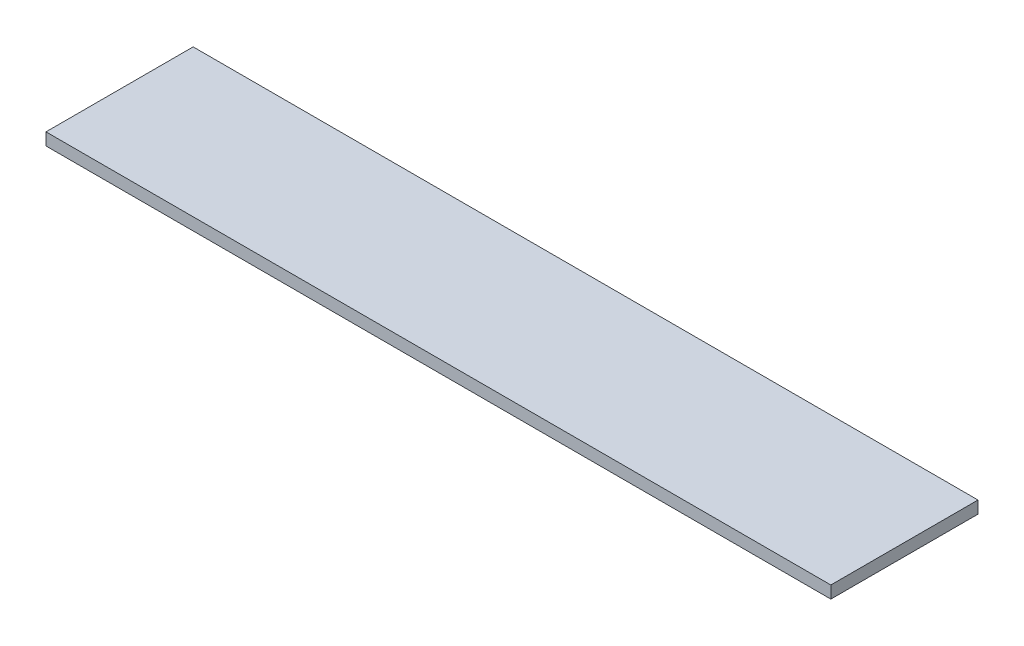
ISO-10303-21;
HEADER;
FILE_DESCRIPTION(('STEP AP214'),'2;1');
FILE_NAME('part.step','',(''),(''),'','','');
FILE_SCHEMA(('AUTOMOTIVE_DESIGN { 1 0 10303 214 1 1 1 1 }'));
ENDSEC;
DATA;
#1=APPLICATION_CONTEXT('core data for automotive mechanical design processes');
#2=APPLICATION_PROTOCOL_DEFINITION('international standard','automotive_design',2000,#1);
#3=PRODUCT_CONTEXT('',#1,'mechanical');
#4=PRODUCT('Part','Part','',(#3));
#5=PRODUCT_RELATED_PRODUCT_CATEGORY('part','',(#4));
#6=PRODUCT_DEFINITION_FORMATION('','',#4);
#7=PRODUCT_DEFINITION_CONTEXT('part definition',#1,'design');
#8=PRODUCT_DEFINITION('design','',#6,#7);
#9=PRODUCT_DEFINITION_SHAPE('','',#8);
#10=(LENGTH_UNIT() NAMED_UNIT(*) SI_UNIT(.MILLI.,.METRE.));
#11=(NAMED_UNIT(*) PLANE_ANGLE_UNIT() SI_UNIT($,.RADIAN.));
#12=(NAMED_UNIT(*) SI_UNIT($,.STERADIAN.) SOLID_ANGLE_UNIT());
#13=UNCERTAINTY_MEASURE_WITH_UNIT(LENGTH_MEASURE(1.E-05),#10,'distance_accuracy_value','');
#14=(GEOMETRIC_REPRESENTATION_CONTEXT(3) GLOBAL_UNCERTAINTY_ASSIGNED_CONTEXT((#13)) GLOBAL_UNIT_ASSIGNED_CONTEXT((#10,
#11,#12)) REPRESENTATION_CONTEXT('',''));
#15=CARTESIAN_POINT('',(0.,0.,0.));
#16=DIRECTION('',(0.,0.,1.));
#17=DIRECTION('',(1.,0.,0.));
#18=AXIS2_PLACEMENT_3D('',#15,#16,#17);
#19=CARTESIAN_POINT('',(0.,6.35,0.));
#20=DIRECTION('',(1.,0.,0.));
#21=DIRECTION('',(0.,0.,1.));
#22=AXIS2_PLACEMENT_3D('',#19,#20,#21);
#23=PLANE('',#22);
#24=DIRECTION('',(0.,0.,-1.));
#25=VECTOR('',#24,1.);
#26=CARTESIAN_POINT('',(0.,0.,0.));
#27=LINE('',#26,#25);
#28=CARTESIAN_POINT('',(0.,0.,76.2));
#29=VERTEX_POINT('',#28);
#30=CARTESIAN_POINT('',(0.,0.,0.));
#31=VERTEX_POINT('',#30);
#32=EDGE_CURVE('E102',#29,#31,#27,.T.);
#33=ORIENTED_EDGE('',*,*,#32,.F.);
#34=DIRECTION('',(0.,-1.,0.));
#35=VECTOR('',#34,1.);
#36=CARTESIAN_POINT('',(0.,6.35,76.2));
#37=LINE('',#36,#35);
#38=CARTESIAN_POINT('',(0.,6.35,76.2));
#39=VERTEX_POINT('',#38);
#40=EDGE_CURVE('E101',#39,#29,#37,.T.);
#41=ORIENTED_EDGE('',*,*,#40,.F.);
#42=DIRECTION('',(0.,0.,-1.));
#43=VECTOR('',#42,1.);
#44=CARTESIAN_POINT('',(0.,6.35,0.));
#45=LINE('',#44,#43);
#46=CARTESIAN_POINT('',(0.,6.35,0.));
#47=VERTEX_POINT('',#46);
#48=EDGE_CURVE('E96',#39,#47,#45,.T.);
#49=ORIENTED_EDGE('',*,*,#48,.T.);
#50=DIRECTION('',(0.,-1.,0.));
#51=VECTOR('',#50,1.);
#52=CARTESIAN_POINT('',(0.,6.35,0.));
#53=LINE('',#52,#51);
#54=EDGE_CURVE('E11',#47,#31,#53,.T.);
#55=ORIENTED_EDGE('',*,*,#54,.T.);
#56=EDGE_LOOP('',(#33,#41,#49,#55));
#57=FACE_BOUND('',#56,.T.);
#58=ADVANCED_FACE('F39',(#57),#23,.F.);
#59=CARTESIAN_POINT('',(0.,6.35,0.));
#60=DIRECTION('',(0.,0.,1.));
#61=DIRECTION('',(-1.,0.,0.));
#62=AXIS2_PLACEMENT_3D('',#59,#60,#61);
#63=PLANE('',#62);
#64=DIRECTION('',(1.,0.,0.));
#65=VECTOR('',#64,1.);
#66=CARTESIAN_POINT('',(0.,0.,0.));
#67=LINE('',#66,#65);
#68=CARTESIAN_POINT('',(406.4,0.,0.));
#69=VERTEX_POINT('',#68);
#70=EDGE_CURVE('E104',#31,#69,#67,.T.);
#71=ORIENTED_EDGE('',*,*,#70,.F.);
#72=ORIENTED_EDGE('',*,*,#54,.F.);
#73=DIRECTION('',(1.,0.,0.));
#74=VECTOR('',#73,1.);
#75=CARTESIAN_POINT('',(0.,6.35,0.));
#76=LINE('',#75,#74);
#77=CARTESIAN_POINT('',(406.4,6.35,0.));
#78=VERTEX_POINT('',#77);
#79=EDGE_CURVE('E80',#47,#78,#76,.T.);
#80=ORIENTED_EDGE('',*,*,#79,.T.);
#81=DIRECTION('',(0.,-1.,0.));
#82=VECTOR('',#81,1.);
#83=CARTESIAN_POINT('',(406.4,6.35,0.));
#84=LINE('',#83,#82);
#85=EDGE_CURVE('E47',#78,#69,#84,.T.);
#86=ORIENTED_EDGE('',*,*,#85,.T.);
#87=EDGE_LOOP('',(#71,#72,#80,#86));
#88=FACE_BOUND('',#87,.T.);
#89=ADVANCED_FACE('F94',(#88),#63,.F.);
#90=CARTESIAN_POINT('',(406.4,6.35,0.));
#91=DIRECTION('',(-1.,0.,0.));
#92=DIRECTION('',(0.,0.,-1.));
#93=AXIS2_PLACEMENT_3D('',#90,#91,#92);
#94=PLANE('',#93);
#95=DIRECTION('',(0.,0.,1.));
#96=VECTOR('',#95,1.);
#97=CARTESIAN_POINT('',(406.4,0.,0.));
#98=LINE('',#97,#96);
#99=CARTESIAN_POINT('',(406.4,0.,76.2));
#100=VERTEX_POINT('',#99);
#101=EDGE_CURVE('E90',#69,#100,#98,.T.);
#102=ORIENTED_EDGE('',*,*,#101,.F.);
#103=ORIENTED_EDGE('',*,*,#85,.F.);
#104=DIRECTION('',(0.,0.,1.));
#105=VECTOR('',#104,1.);
#106=CARTESIAN_POINT('',(406.4,6.35,0.));
#107=LINE('',#106,#105);
#108=CARTESIAN_POINT('',(406.4,6.35,76.2));
#109=VERTEX_POINT('',#108);
#110=EDGE_CURVE('E83',#78,#109,#107,.T.);
#111=ORIENTED_EDGE('',*,*,#110,.T.);
#112=DIRECTION('',(0.,-1.,0.));
#113=VECTOR('',#112,1.);
#114=CARTESIAN_POINT('',(406.4,6.35,76.2));
#115=LINE('',#114,#113);
#116=EDGE_CURVE('E93',#109,#100,#115,.T.);
#117=ORIENTED_EDGE('',*,*,#116,.T.);
#118=EDGE_LOOP('',(#102,#103,#111,#117));
#119=FACE_BOUND('',#118,.T.);
#120=ADVANCED_FACE('F89',(#119),#94,.F.);
#121=CARTESIAN_POINT('',(0.,6.35,76.2));
#122=DIRECTION('',(0.,0.,-1.));
#123=DIRECTION('',(1.,0.,0.));
#124=AXIS2_PLACEMENT_3D('',#121,#122,#123);
#125=PLANE('',#124);
#126=DIRECTION('',(-1.,0.,0.));
#127=VECTOR('',#126,1.);
#128=CARTESIAN_POINT('',(0.,0.,76.2));
#129=LINE('',#128,#127);
#130=EDGE_CURVE('E69',#100,#29,#129,.T.);
#131=ORIENTED_EDGE('',*,*,#130,.F.);
#132=ORIENTED_EDGE('',*,*,#116,.F.);
#133=DIRECTION('',(-1.,0.,0.));
#134=VECTOR('',#133,1.);
#135=CARTESIAN_POINT('',(0.,6.35,76.2));
#136=LINE('',#135,#134);
#137=EDGE_CURVE('E55',#109,#39,#136,.T.);
#138=ORIENTED_EDGE('',*,*,#137,.T.);
#139=ORIENTED_EDGE('',*,*,#40,.T.);
#140=EDGE_LOOP('',(#131,#132,#138,#139));
#141=FACE_BOUND('',#140,.T.);
#142=ADVANCED_FACE('F113',(#141),#125,.F.);
#143=CARTESIAN_POINT('',(0.,6.35,0.));
#144=DIRECTION('',(0.,-1.,0.));
#145=DIRECTION('',(0.,0.,1.));
#146=AXIS2_PLACEMENT_3D('',#143,#144,#145);
#147=PLANE('',#146);
#148=ORIENTED_EDGE('',*,*,#48,.F.);
#149=ORIENTED_EDGE('',*,*,#137,.F.);
#150=ORIENTED_EDGE('',*,*,#110,.F.);
#151=ORIENTED_EDGE('',*,*,#79,.F.);
#152=EDGE_LOOP('',(#148,#149,#150,#151));
#153=FACE_BOUND('',#152,.T.);
#154=ADVANCED_FACE('F85',(#153),#147,.F.);
#155=CARTESIAN_POINT('',(0.,0.,0.));
#156=DIRECTION('',(0.,-1.,0.));
#157=DIRECTION('',(0.,0.,1.));
#158=AXIS2_PLACEMENT_3D('',#155,#156,#157);
#159=PLANE('',#158);
#160=ORIENTED_EDGE('',*,*,#32,.T.);
#161=ORIENTED_EDGE('',*,*,#70,.T.);
#162=ORIENTED_EDGE('',*,*,#101,.T.);
#163=ORIENTED_EDGE('',*,*,#130,.T.);
#164=EDGE_LOOP('',(#160,#161,#162,#163));
#165=FACE_BOUND('',#164,.T.);
#166=ADVANCED_FACE('F109',(#165),#159,.T.);
#167=CLOSED_SHELL('',(#58,#89,#120,#142,#154,#166));
#168=MANIFOLD_SOLID_BREP('B2',#167);
#169=ADVANCED_BREP_SHAPE_REPRESENTATION('',(#18,#168),#14);
#170=SHAPE_DEFINITION_REPRESENTATION(#9,#169);
ENDSEC;
END-ISO-10303-21;
